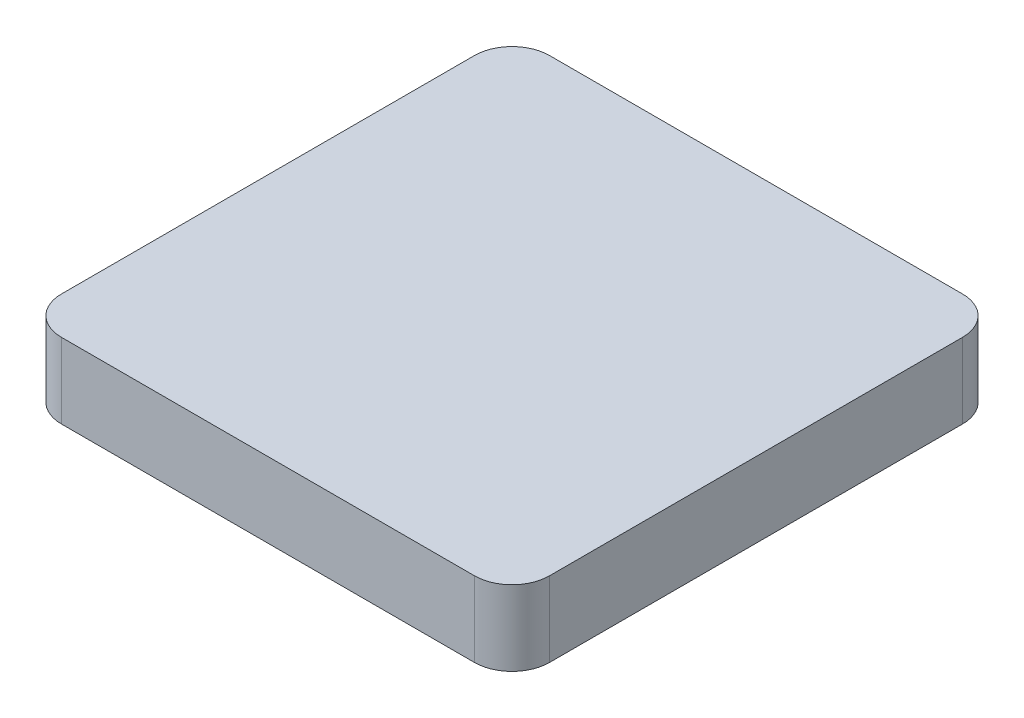
ISO-10303-21;
HEADER;
FILE_DESCRIPTION(('STEP AP214'),'2;1');
FILE_NAME('part.step','',(''),(''),'','','');
FILE_SCHEMA(('AUTOMOTIVE_DESIGN { 1 0 10303 214 1 1 1 1 }'));
ENDSEC;
DATA;
#1=APPLICATION_CONTEXT('core data for automotive mechanical design processes');
#2=APPLICATION_PROTOCOL_DEFINITION('international standard','automotive_design',2000,#1);
#3=PRODUCT_CONTEXT('',#1,'mechanical');
#4=PRODUCT('Part','Part','',(#3));
#5=PRODUCT_RELATED_PRODUCT_CATEGORY('part','',(#4));
#6=PRODUCT_DEFINITION_FORMATION('','',#4);
#7=PRODUCT_DEFINITION_CONTEXT('part definition',#1,'design');
#8=PRODUCT_DEFINITION('design','',#6,#7);
#9=PRODUCT_DEFINITION_SHAPE('','',#8);
#10=(LENGTH_UNIT() NAMED_UNIT(*) SI_UNIT(.MILLI.,.METRE.));
#11=(NAMED_UNIT(*) PLANE_ANGLE_UNIT() SI_UNIT($,.RADIAN.));
#12=(NAMED_UNIT(*) SI_UNIT($,.STERADIAN.) SOLID_ANGLE_UNIT());
#13=UNCERTAINTY_MEASURE_WITH_UNIT(LENGTH_MEASURE(1.E-05),#10,'distance_accuracy_value','');
#14=(GEOMETRIC_REPRESENTATION_CONTEXT(3) GLOBAL_UNCERTAINTY_ASSIGNED_CONTEXT((#13)) GLOBAL_UNIT_ASSIGNED_CONTEXT((#10,
#11,#12)) REPRESENTATION_CONTEXT('',''));
#15=CARTESIAN_POINT('',(0.,0.,0.));
#16=DIRECTION('',(0.,0.,1.));
#17=DIRECTION('',(1.,0.,0.));
#18=AXIS2_PLACEMENT_3D('',#15,#16,#17);
#19=CARTESIAN_POINT('',(5.5,2.,5.5));
#20=DIRECTION('',(0.,-1.,0.));
#21=DIRECTION('',(0.,0.,-1.));
#22=AXIS2_PLACEMENT_3D('',#19,#20,#21);
#23=CYLINDRICAL_SURFACE('',#22,1.);
#24=CARTESIAN_POINT('',(5.5,0.,5.5));
#25=DIRECTION('',(0.,1.,0.));
#26=DIRECTION('',(0.,0.,-1.));
#27=AXIS2_PLACEMENT_3D('',#24,#25,#26);
#28=CIRCLE('',#27,1.);
#29=CARTESIAN_POINT('',(5.49999999999999,0.,6.5));
#30=VERTEX_POINT('',#29);
#31=CARTESIAN_POINT('',(6.5,0.,5.49999999999999));
#32=VERTEX_POINT('',#31);
#33=EDGE_CURVE('E128',#30,#32,#28,.T.);
#34=ORIENTED_EDGE('',*,*,#33,.T.);
#35=DIRECTION('',(0.,-1.,0.));
#36=VECTOR('',#35,1.);
#37=CARTESIAN_POINT('',(6.5,2.,5.49999999999999));
#38=LINE('',#37,#36);
#39=CARTESIAN_POINT('',(6.5,2.,5.49999999999999));
#40=VERTEX_POINT('',#39);
#41=EDGE_CURVE('E11',#40,#32,#38,.T.);
#42=ORIENTED_EDGE('',*,*,#41,.F.);
#43=CARTESIAN_POINT('',(5.5,2.,5.5));
#44=DIRECTION('',(0.,1.,0.));
#45=DIRECTION('',(0.,0.,-1.));
#46=AXIS2_PLACEMENT_3D('',#43,#44,#45);
#47=CIRCLE('',#46,1.);
#48=CARTESIAN_POINT('',(5.49999999999999,2.,6.5));
#49=VERTEX_POINT('',#48);
#50=EDGE_CURVE('E142',#49,#40,#47,.T.);
#51=ORIENTED_EDGE('',*,*,#50,.F.);
#52=DIRECTION('',(0.,-1.,0.));
#53=VECTOR('',#52,1.);
#54=CARTESIAN_POINT('',(5.49999999999999,2.,6.5));
#55=LINE('',#54,#53);
#56=EDGE_CURVE('E124',#49,#30,#55,.T.);
#57=ORIENTED_EDGE('',*,*,#56,.T.);
#58=EDGE_LOOP('',(#34,#42,#51,#57));
#59=FACE_BOUND('',#58,.T.);
#60=ADVANCED_FACE('F32',(#59),#23,.T.);
#61=CARTESIAN_POINT('',(6.5,2.,5.49999999999999));
#62=DIRECTION('',(-1.,0.,0.));
#63=DIRECTION('',(0.,0.,1.));
#64=AXIS2_PLACEMENT_3D('',#61,#62,#63);
#65=PLANE('',#64);
#66=DIRECTION('',(0.,0.,-1.));
#67=VECTOR('',#66,1.);
#68=CARTESIAN_POINT('',(6.5,0.,5.49999999999999));
#69=LINE('',#68,#67);
#70=CARTESIAN_POINT('',(6.5,0.,-5.49999999999999));
#71=VERTEX_POINT('',#70);
#72=EDGE_CURVE('E131',#32,#71,#69,.T.);
#73=ORIENTED_EDGE('',*,*,#72,.T.);
#74=DIRECTION('',(0.,-1.,0.));
#75=VECTOR('',#74,1.);
#76=CARTESIAN_POINT('',(6.5,2.,-5.49999999999999));
#77=LINE('',#76,#75);
#78=CARTESIAN_POINT('',(6.5,2.,-5.49999999999999));
#79=VERTEX_POINT('',#78);
#80=EDGE_CURVE('E40',#79,#71,#77,.T.);
#81=ORIENTED_EDGE('',*,*,#80,.F.);
#82=DIRECTION('',(0.,0.,-1.));
#83=VECTOR('',#82,1.);
#84=CARTESIAN_POINT('',(6.5,2.,5.49999999999999));
#85=LINE('',#84,#83);
#86=EDGE_CURVE('E91',#40,#79,#85,.T.);
#87=ORIENTED_EDGE('',*,*,#86,.F.);
#88=ORIENTED_EDGE('',*,*,#41,.T.);
#89=EDGE_LOOP('',(#73,#81,#87,#88));
#90=FACE_BOUND('',#89,.T.);
#91=ADVANCED_FACE('F177',(#90),#65,.F.);
#92=CARTESIAN_POINT('',(5.5,2.,-5.5));
#93=DIRECTION('',(0.,-1.,0.));
#94=DIRECTION('',(0.,0.,-1.));
#95=AXIS2_PLACEMENT_3D('',#92,#93,#94);
#96=CYLINDRICAL_SURFACE('',#95,1.);
#97=CARTESIAN_POINT('',(5.5,0.,-5.5));
#98=DIRECTION('',(0.,1.,0.));
#99=DIRECTION('',(0.,0.,1.));
#100=AXIS2_PLACEMENT_3D('',#97,#98,#99);
#101=CIRCLE('',#100,1.);
#102=CARTESIAN_POINT('',(5.49999999999999,0.,-6.5));
#103=VERTEX_POINT('',#102);
#104=EDGE_CURVE('E133',#71,#103,#101,.T.);
#105=ORIENTED_EDGE('',*,*,#104,.T.);
#106=DIRECTION('',(0.,-1.,0.));
#107=VECTOR('',#106,1.);
#108=CARTESIAN_POINT('',(5.49999999999999,2.,-6.5));
#109=LINE('',#108,#107);
#110=CARTESIAN_POINT('',(5.49999999999999,2.,-6.5));
#111=VERTEX_POINT('',#110);
#112=EDGE_CURVE('E149',#111,#103,#109,.T.);
#113=ORIENTED_EDGE('',*,*,#112,.F.);
#114=CARTESIAN_POINT('',(5.5,2.,-5.5));
#115=DIRECTION('',(0.,1.,0.));
#116=DIRECTION('',(0.,0.,1.));
#117=AXIS2_PLACEMENT_3D('',#114,#115,#116);
#118=CIRCLE('',#117,1.);
#119=EDGE_CURVE('E157',#79,#111,#118,.T.);
#120=ORIENTED_EDGE('',*,*,#119,.F.);
#121=ORIENTED_EDGE('',*,*,#80,.T.);
#122=EDGE_LOOP('',(#105,#113,#120,#121));
#123=FACE_BOUND('',#122,.T.);
#124=ADVANCED_FACE('F155',(#123),#96,.T.);
#125=CARTESIAN_POINT('',(5.49999999999999,2.,-6.5));
#126=DIRECTION('',(0.,0.,1.));
#127=DIRECTION('',(1.,0.,0.));
#128=AXIS2_PLACEMENT_3D('',#125,#126,#127);
#129=PLANE('',#128);
#130=DIRECTION('',(-1.,0.,0.));
#131=VECTOR('',#130,1.);
#132=CARTESIAN_POINT('',(5.49999999999999,0.,-6.5));
#133=LINE('',#132,#131);
#134=CARTESIAN_POINT('',(-5.49999999999999,0.,-6.5));
#135=VERTEX_POINT('',#134);
#136=EDGE_CURVE('E135',#103,#135,#133,.T.);
#137=ORIENTED_EDGE('',*,*,#136,.T.);
#138=DIRECTION('',(0.,-1.,0.));
#139=VECTOR('',#138,1.);
#140=CARTESIAN_POINT('',(-5.49999999999999,2.,-6.5));
#141=LINE('',#140,#139);
#142=CARTESIAN_POINT('',(-5.49999999999999,2.,-6.5));
#143=VERTEX_POINT('',#142);
#144=EDGE_CURVE('E146',#143,#135,#141,.T.);
#145=ORIENTED_EDGE('',*,*,#144,.F.);
#146=DIRECTION('',(-1.,0.,0.));
#147=VECTOR('',#146,1.);
#148=CARTESIAN_POINT('',(5.49999999999999,2.,-6.5));
#149=LINE('',#148,#147);
#150=EDGE_CURVE('E169',#111,#143,#149,.T.);
#151=ORIENTED_EDGE('',*,*,#150,.F.);
#152=ORIENTED_EDGE('',*,*,#112,.T.);
#153=EDGE_LOOP('',(#137,#145,#151,#152));
#154=FACE_BOUND('',#153,.T.);
#155=ADVANCED_FACE('F165',(#154),#129,.F.);
#156=CARTESIAN_POINT('',(-5.5,2.,-5.5));
#157=DIRECTION('',(0.,-1.,0.));
#158=DIRECTION('',(0.,0.,-1.));
#159=AXIS2_PLACEMENT_3D('',#156,#157,#158);
#160=CYLINDRICAL_SURFACE('',#159,1.);
#161=CARTESIAN_POINT('',(-5.5,0.,-5.5));
#162=DIRECTION('',(0.,1.,0.));
#163=DIRECTION('',(0.,0.,1.));
#164=AXIS2_PLACEMENT_3D('',#161,#162,#163);
#165=CIRCLE('',#164,1.);
#166=CARTESIAN_POINT('',(-6.5,0.,-5.49999999999999));
#167=VERTEX_POINT('',#166);
#168=EDGE_CURVE('E137',#135,#167,#165,.T.);
#169=ORIENTED_EDGE('',*,*,#168,.T.);
#170=DIRECTION('',(0.,-1.,0.));
#171=VECTOR('',#170,1.);
#172=CARTESIAN_POINT('',(-6.5,2.,-5.49999999999999));
#173=LINE('',#172,#171);
#174=CARTESIAN_POINT('',(-6.5,2.,-5.49999999999999));
#175=VERTEX_POINT('',#174);
#176=EDGE_CURVE('E119',#175,#167,#173,.T.);
#177=ORIENTED_EDGE('',*,*,#176,.F.);
#178=CARTESIAN_POINT('',(-5.5,2.,-5.5));
#179=DIRECTION('',(0.,1.,0.));
#180=DIRECTION('',(0.,0.,1.));
#181=AXIS2_PLACEMENT_3D('',#178,#179,#180);
#182=CIRCLE('',#181,1.);
#183=EDGE_CURVE('E110',#143,#175,#182,.T.);
#184=ORIENTED_EDGE('',*,*,#183,.F.);
#185=ORIENTED_EDGE('',*,*,#144,.T.);
#186=EDGE_LOOP('',(#169,#177,#184,#185));
#187=FACE_BOUND('',#186,.T.);
#188=ADVANCED_FACE('F168',(#187),#160,.T.);
#189=CARTESIAN_POINT('',(-6.5,2.,5.49999999999999));
#190=DIRECTION('',(1.,0.,0.));
#191=DIRECTION('',(0.,0.,-1.));
#192=AXIS2_PLACEMENT_3D('',#189,#190,#191);
#193=PLANE('',#192);
#194=DIRECTION('',(0.,0.,1.));
#195=VECTOR('',#194,1.);
#196=CARTESIAN_POINT('',(-6.5,0.,5.49999999999999));
#197=LINE('',#196,#195);
#198=CARTESIAN_POINT('',(-6.5,0.,5.49999999999999));
#199=VERTEX_POINT('',#198);
#200=EDGE_CURVE('E118',#167,#199,#197,.T.);
#201=ORIENTED_EDGE('',*,*,#200,.T.);
#202=DIRECTION('',(0.,-1.,0.));
#203=VECTOR('',#202,1.);
#204=CARTESIAN_POINT('',(-6.5,2.,5.49999999999999));
#205=LINE('',#204,#203);
#206=CARTESIAN_POINT('',(-6.5,2.,5.49999999999999));
#207=VERTEX_POINT('',#206);
#208=EDGE_CURVE('E115',#207,#199,#205,.T.);
#209=ORIENTED_EDGE('',*,*,#208,.F.);
#210=DIRECTION('',(0.,0.,1.));
#211=VECTOR('',#210,1.);
#212=CARTESIAN_POINT('',(-6.5,2.,5.49999999999999));
#213=LINE('',#212,#211);
#214=EDGE_CURVE('E104',#175,#207,#213,.T.);
#215=ORIENTED_EDGE('',*,*,#214,.F.);
#216=ORIENTED_EDGE('',*,*,#176,.T.);
#217=EDGE_LOOP('',(#201,#209,#215,#216));
#218=FACE_BOUND('',#217,.T.);
#219=ADVANCED_FACE('F116',(#218),#193,.F.);
#220=CARTESIAN_POINT('',(-5.5,2.,5.5));
#221=DIRECTION('',(0.,-1.,0.));
#222=DIRECTION('',(0.,0.,-1.));
#223=AXIS2_PLACEMENT_3D('',#220,#221,#222);
#224=CYLINDRICAL_SURFACE('',#223,1.);
#225=CARTESIAN_POINT('',(-5.5,0.,5.5));
#226=DIRECTION('',(0.,1.,0.));
#227=DIRECTION('',(0.,0.,-1.));
#228=AXIS2_PLACEMENT_3D('',#225,#226,#227);
#229=CIRCLE('',#228,1.);
#230=CARTESIAN_POINT('',(-5.49999999999999,0.,6.5));
#231=VERTEX_POINT('',#230);
#232=EDGE_CURVE('E77',#199,#231,#229,.T.);
#233=ORIENTED_EDGE('',*,*,#232,.T.);
#234=DIRECTION('',(0.,-1.,0.));
#235=VECTOR('',#234,1.);
#236=CARTESIAN_POINT('',(-5.49999999999999,2.,6.5));
#237=LINE('',#236,#235);
#238=CARTESIAN_POINT('',(-5.49999999999999,2.,6.5));
#239=VERTEX_POINT('',#238);
#240=EDGE_CURVE('E120',#239,#231,#237,.T.);
#241=ORIENTED_EDGE('',*,*,#240,.F.);
#242=CARTESIAN_POINT('',(-5.5,2.,5.5));
#243=DIRECTION('',(0.,1.,0.));
#244=DIRECTION('',(0.,0.,-1.));
#245=AXIS2_PLACEMENT_3D('',#242,#243,#244);
#246=CIRCLE('',#245,1.);
#247=EDGE_CURVE('E108',#207,#239,#246,.T.);
#248=ORIENTED_EDGE('',*,*,#247,.F.);
#249=ORIENTED_EDGE('',*,*,#208,.T.);
#250=EDGE_LOOP('',(#233,#241,#248,#249));
#251=FACE_BOUND('',#250,.T.);
#252=ADVANCED_FACE('F122',(#251),#224,.T.);
#253=CARTESIAN_POINT('',(5.49999999999999,2.,6.5));
#254=DIRECTION('',(0.,0.,-1.));
#255=DIRECTION('',(-1.,0.,0.));
#256=AXIS2_PLACEMENT_3D('',#253,#254,#255);
#257=PLANE('',#256);
#258=DIRECTION('',(1.,0.,0.));
#259=VECTOR('',#258,1.);
#260=CARTESIAN_POINT('',(5.49999999999999,0.,6.5));
#261=LINE('',#260,#259);
#262=EDGE_CURVE('E83',#231,#30,#261,.T.);
#263=ORIENTED_EDGE('',*,*,#262,.T.);
#264=ORIENTED_EDGE('',*,*,#56,.F.);
#265=DIRECTION('',(1.,0.,0.));
#266=VECTOR('',#265,1.);
#267=CARTESIAN_POINT('',(5.49999999999999,2.,6.5));
#268=LINE('',#267,#266);
#269=EDGE_CURVE('E48',#239,#49,#268,.T.);
#270=ORIENTED_EDGE('',*,*,#269,.F.);
#271=ORIENTED_EDGE('',*,*,#240,.T.);
#272=EDGE_LOOP('',(#263,#264,#270,#271));
#273=FACE_BOUND('',#272,.T.);
#274=ADVANCED_FACE('F193',(#273),#257,.F.);
#275=CARTESIAN_POINT('',(5.5,2.,5.5));
#276=DIRECTION('',(0.,-1.,0.));
#277=DIRECTION('',(0.,0.,-1.));
#278=AXIS2_PLACEMENT_3D('',#275,#276,#277);
#279=PLANE('',#278);
#280=ORIENTED_EDGE('',*,*,#50,.T.);
#281=ORIENTED_EDGE('',*,*,#86,.T.);
#282=ORIENTED_EDGE('',*,*,#119,.T.);
#283=ORIENTED_EDGE('',*,*,#150,.T.);
#284=ORIENTED_EDGE('',*,*,#183,.T.);
#285=ORIENTED_EDGE('',*,*,#214,.T.);
#286=ORIENTED_EDGE('',*,*,#247,.T.);
#287=ORIENTED_EDGE('',*,*,#269,.T.);
#288=EDGE_LOOP('',(#280,#281,#282,#283,#284,#285,#286,#287));
#289=FACE_BOUND('',#288,.T.);
#290=ADVANCED_FACE('F106',(#289),#279,.F.);
#291=CARTESIAN_POINT('',(5.5,0.,5.5));
#292=DIRECTION('',(0.,-1.,0.));
#293=DIRECTION('',(0.,0.,-1.));
#294=AXIS2_PLACEMENT_3D('',#291,#292,#293);
#295=PLANE('',#294);
#296=ORIENTED_EDGE('',*,*,#33,.F.);
#297=ORIENTED_EDGE('',*,*,#262,.F.);
#298=ORIENTED_EDGE('',*,*,#232,.F.);
#299=ORIENTED_EDGE('',*,*,#200,.F.);
#300=ORIENTED_EDGE('',*,*,#168,.F.);
#301=ORIENTED_EDGE('',*,*,#136,.F.);
#302=ORIENTED_EDGE('',*,*,#104,.F.);
#303=ORIENTED_EDGE('',*,*,#72,.F.);
#304=EDGE_LOOP('',(#296,#297,#298,#299,#300,#301,#302,#303));
#305=FACE_BOUND('',#304,.T.);
#306=ADVANCED_FACE('F161',(#305),#295,.T.);
#307=CLOSED_SHELL('',(#60,#91,#124,#155,#188,#219,#252,#274,#290,#306));
#308=MANIFOLD_SOLID_BREP('B2',#307);
#309=ADVANCED_BREP_SHAPE_REPRESENTATION('',(#18,#308),#14);
#310=SHAPE_DEFINITION_REPRESENTATION(#9,#309);
ENDSEC;
END-ISO-10303-21;
